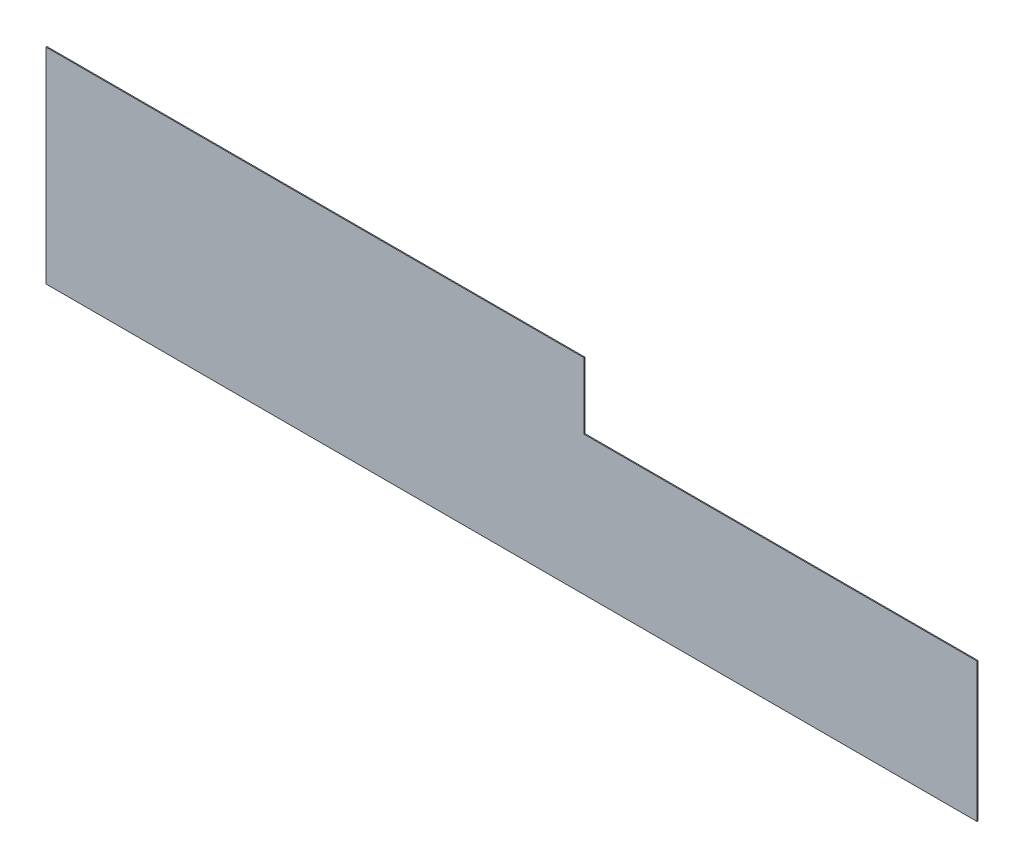
ISO-10303-21;
HEADER;
FILE_DESCRIPTION(('STEP AP214'),'2;1');
FILE_NAME('part.step','',(''),(''),'','','');
FILE_SCHEMA(('AUTOMOTIVE_DESIGN { 1 0 10303 214 1 1 1 1 }'));
ENDSEC;
DATA;
#1=APPLICATION_CONTEXT('core data for automotive mechanical design processes');
#2=APPLICATION_PROTOCOL_DEFINITION('international standard','automotive_design',2000,#1);
#3=PRODUCT_CONTEXT('',#1,'mechanical');
#4=PRODUCT('Part','Part','',(#3));
#5=PRODUCT_RELATED_PRODUCT_CATEGORY('part','',(#4));
#6=PRODUCT_DEFINITION_FORMATION('','',#4);
#7=PRODUCT_DEFINITION_CONTEXT('part definition',#1,'design');
#8=PRODUCT_DEFINITION('design','',#6,#7);
#9=PRODUCT_DEFINITION_SHAPE('','',#8);
#10=(LENGTH_UNIT() NAMED_UNIT(*) SI_UNIT(.MILLI.,.METRE.));
#11=(NAMED_UNIT(*) PLANE_ANGLE_UNIT() SI_UNIT($,.RADIAN.));
#12=(NAMED_UNIT(*) SI_UNIT($,.STERADIAN.) SOLID_ANGLE_UNIT());
#13=UNCERTAINTY_MEASURE_WITH_UNIT(LENGTH_MEASURE(1.E-05),#10,'distance_accuracy_value','');
#14=(GEOMETRIC_REPRESENTATION_CONTEXT(3) GLOBAL_UNCERTAINTY_ASSIGNED_CONTEXT((#13)) GLOBAL_UNIT_ASSIGNED_CONTEXT((#10,
#11,#12)) REPRESENTATION_CONTEXT('',''));
#15=CARTESIAN_POINT('',(0.,0.,0.));
#16=DIRECTION('',(0.,0.,1.));
#17=DIRECTION('',(1.,0.,0.));
#18=AXIS2_PLACEMENT_3D('',#15,#16,#17);
#19=CARTESIAN_POINT('',(5695.,-2.79062878280622E-13,-6.));
#20=DIRECTION('',(0.,-1.,0.));
#21=DIRECTION('',(1.,0.,0.));
#22=AXIS2_PLACEMENT_3D('',#19,#20,#21);
#23=PLANE('',#22);
#24=DIRECTION('',(1.,0.,0.));
#25=VECTOR('',#24,1.);
#26=CARTESIAN_POINT('',(5695.,-2.79062878280622E-13,0.));
#27=LINE('',#26,#25);
#28=CARTESIAN_POINT('',(0.,0.,0.));
#29=VERTEX_POINT('',#28);
#30=CARTESIAN_POINT('',(5695.,-2.79062878280622E-13,0.));
#31=VERTEX_POINT('',#30);
#32=EDGE_CURVE('E123',#29,#31,#27,.T.);
#33=ORIENTED_EDGE('',*,*,#32,.F.);
#34=DIRECTION('',(0.,0.,1.));
#35=VECTOR('',#34,1.);
#36=CARTESIAN_POINT('',(0.,0.,-6.));
#37=LINE('',#36,#35);
#38=CARTESIAN_POINT('',(0.,0.,-6.));
#39=VERTEX_POINT('',#38);
#40=EDGE_CURVE('E11',#39,#29,#37,.T.);
#41=ORIENTED_EDGE('',*,*,#40,.F.);
#42=DIRECTION('',(1.,0.,0.));
#43=VECTOR('',#42,1.);
#44=CARTESIAN_POINT('',(5695.,-2.79062878280622E-13,-6.));
#45=LINE('',#44,#43);
#46=CARTESIAN_POINT('',(5695.,-2.79062878280622E-13,-6.));
#47=VERTEX_POINT('',#46);
#48=EDGE_CURVE('E137',#39,#47,#45,.T.);
#49=ORIENTED_EDGE('',*,*,#48,.T.);
#50=DIRECTION('',(0.,0.,1.));
#51=VECTOR('',#50,1.);
#52=CARTESIAN_POINT('',(5695.,-2.79062878280622E-13,-6.));
#53=LINE('',#52,#51);
#54=EDGE_CURVE('E41',#47,#31,#53,.T.);
#55=ORIENTED_EDGE('',*,*,#54,.T.);
#56=EDGE_LOOP('',(#33,#41,#49,#55));
#57=FACE_BOUND('',#56,.T.);
#58=ADVANCED_FACE('F38',(#57),#23,.T.);
#59=CARTESIAN_POINT('',(0.,0.,-6.));
#60=DIRECTION('',(-1.,0.,0.));
#61=DIRECTION('',(0.,-1.,0.));
#62=AXIS2_PLACEMENT_3D('',#59,#60,#61);
#63=PLANE('',#62);
#64=DIRECTION('',(0.,-1.,0.));
#65=VECTOR('',#64,1.);
#66=CARTESIAN_POINT('',(0.,0.,0.));
#67=LINE('',#66,#65);
#68=CARTESIAN_POINT('',(4.44089209850063E-13,1255.,0.));
#69=VERTEX_POINT('',#68);
#70=EDGE_CURVE('E135',#69,#29,#67,.T.);
#71=ORIENTED_EDGE('',*,*,#70,.F.);
#72=DIRECTION('',(0.,0.,1.));
#73=VECTOR('',#72,1.);
#74=CARTESIAN_POINT('',(4.44089209850063E-13,1255.,-6.));
#75=LINE('',#74,#73);
#76=CARTESIAN_POINT('',(4.44089209850063E-13,1255.,-6.));
#77=VERTEX_POINT('',#76);
#78=EDGE_CURVE('E47',#77,#69,#75,.T.);
#79=ORIENTED_EDGE('',*,*,#78,.F.);
#80=DIRECTION('',(0.,-1.,0.));
#81=VECTOR('',#80,1.);
#82=CARTESIAN_POINT('',(0.,0.,-6.));
#83=LINE('',#82,#81);
#84=EDGE_CURVE('E113',#77,#39,#83,.T.);
#85=ORIENTED_EDGE('',*,*,#84,.T.);
#86=ORIENTED_EDGE('',*,*,#40,.T.);
#87=EDGE_LOOP('',(#71,#79,#85,#86));
#88=FACE_BOUND('',#87,.T.);
#89=ADVANCED_FACE('F145',(#88),#63,.T.);
#90=CARTESIAN_POINT('',(4.44089209850063E-13,1255.,-6.));
#91=DIRECTION('',(0.,1.,0.));
#92=DIRECTION('',(0.,0.,1.));
#93=AXIS2_PLACEMENT_3D('',#90,#91,#92);
#94=PLANE('',#93);
#95=DIRECTION('',(-1.,0.,0.));
#96=VECTOR('',#95,1.);
#97=CARTESIAN_POINT('',(4.44089209850063E-13,1255.,0.));
#98=LINE('',#97,#96);
#99=CARTESIAN_POINT('',(3290.,1255.,0.));
#100=VERTEX_POINT('',#99);
#101=EDGE_CURVE('E100',#100,#69,#98,.T.);
#102=ORIENTED_EDGE('',*,*,#101,.F.);
#103=DIRECTION('',(0.,0.,1.));
#104=VECTOR('',#103,1.);
#105=CARTESIAN_POINT('',(3290.,1255.,-6.));
#106=LINE('',#105,#104);
#107=CARTESIAN_POINT('',(3290.,1255.,-6.));
#108=VERTEX_POINT('',#107);
#109=EDGE_CURVE('E95',#108,#100,#106,.T.);
#110=ORIENTED_EDGE('',*,*,#109,.F.);
#111=DIRECTION('',(-1.,0.,0.));
#112=VECTOR('',#111,1.);
#113=CARTESIAN_POINT('',(4.44089209850063E-13,1255.,-6.));
#114=LINE('',#113,#112);
#115=EDGE_CURVE('E98',#108,#77,#114,.T.);
#116=ORIENTED_EDGE('',*,*,#115,.T.);
#117=ORIENTED_EDGE('',*,*,#78,.T.);
#118=EDGE_LOOP('',(#102,#110,#116,#117));
#119=FACE_BOUND('',#118,.T.);
#120=ADVANCED_FACE('F97',(#119),#94,.T.);
#121=CARTESIAN_POINT('',(3290.,1255.,-6.));
#122=DIRECTION('',(1.,0.,0.));
#123=DIRECTION('',(0.,0.,-1.));
#124=AXIS2_PLACEMENT_3D('',#121,#122,#123);
#125=PLANE('',#124);
#126=DIRECTION('',(0.,1.,0.));
#127=VECTOR('',#126,1.);
#128=CARTESIAN_POINT('',(3290.,1255.,0.));
#129=LINE('',#128,#127);
#130=CARTESIAN_POINT('',(3290.,850.,0.));
#131=VERTEX_POINT('',#130);
#132=EDGE_CURVE('E132',#131,#100,#129,.T.);
#133=ORIENTED_EDGE('',*,*,#132,.F.);
#134=DIRECTION('',(0.,0.,1.));
#135=VECTOR('',#134,1.);
#136=CARTESIAN_POINT('',(3290.,850.,-6.));
#137=LINE('',#136,#135);
#138=CARTESIAN_POINT('',(3290.,850.,-6.));
#139=VERTEX_POINT('',#138);
#140=EDGE_CURVE('E105',#139,#131,#137,.T.);
#141=ORIENTED_EDGE('',*,*,#140,.F.);
#142=DIRECTION('',(0.,1.,0.));
#143=VECTOR('',#142,1.);
#144=CARTESIAN_POINT('',(3290.,1255.,-6.));
#145=LINE('',#144,#143);
#146=EDGE_CURVE('E111',#139,#108,#145,.T.);
#147=ORIENTED_EDGE('',*,*,#146,.T.);
#148=ORIENTED_EDGE('',*,*,#109,.T.);
#149=EDGE_LOOP('',(#133,#141,#147,#148));
#150=FACE_BOUND('',#149,.T.);
#151=ADVANCED_FACE('F115',(#150),#125,.T.);
#152=CARTESIAN_POINT('',(3290.,850.,-6.));
#153=DIRECTION('',(0.,1.,0.));
#154=DIRECTION('',(0.,0.,1.));
#155=AXIS2_PLACEMENT_3D('',#152,#153,#154);
#156=PLANE('',#155);
#157=DIRECTION('',(-1.,0.,0.));
#158=VECTOR('',#157,1.);
#159=CARTESIAN_POINT('',(3290.,850.,0.));
#160=LINE('',#159,#158);
#161=CARTESIAN_POINT('',(5695.,850.,0.));
#162=VERTEX_POINT('',#161);
#163=EDGE_CURVE('E129',#162,#131,#160,.T.);
#164=ORIENTED_EDGE('',*,*,#163,.F.);
#165=DIRECTION('',(0.,0.,1.));
#166=VECTOR('',#165,1.);
#167=CARTESIAN_POINT('',(5695.,850.,-6.));
#168=LINE('',#167,#166);
#169=CARTESIAN_POINT('',(5695.,850.,-6.));
#170=VERTEX_POINT('',#169);
#171=EDGE_CURVE('E140',#170,#162,#168,.T.);
#172=ORIENTED_EDGE('',*,*,#171,.F.);
#173=DIRECTION('',(-1.,0.,0.));
#174=VECTOR('',#173,1.);
#175=CARTESIAN_POINT('',(3290.,850.,-6.));
#176=LINE('',#175,#174);
#177=EDGE_CURVE('E116',#170,#139,#176,.T.);
#178=ORIENTED_EDGE('',*,*,#177,.T.);
#179=ORIENTED_EDGE('',*,*,#140,.T.);
#180=EDGE_LOOP('',(#164,#172,#178,#179));
#181=FACE_BOUND('',#180,.T.);
#182=ADVANCED_FACE('F158',(#181),#156,.T.);
#183=CARTESIAN_POINT('',(5695.,850.,-6.));
#184=DIRECTION('',(1.,0.,0.));
#185=DIRECTION('',(0.,0.,-1.));
#186=AXIS2_PLACEMENT_3D('',#183,#184,#185);
#187=PLANE('',#186);
#188=DIRECTION('',(0.,1.,0.));
#189=VECTOR('',#188,1.);
#190=CARTESIAN_POINT('',(5695.,850.,0.));
#191=LINE('',#190,#189);
#192=EDGE_CURVE('E126',#31,#162,#191,.T.);
#193=ORIENTED_EDGE('',*,*,#192,.F.);
#194=ORIENTED_EDGE('',*,*,#54,.F.);
#195=DIRECTION('',(0.,1.,0.));
#196=VECTOR('',#195,1.);
#197=CARTESIAN_POINT('',(5695.,850.,-6.));
#198=LINE('',#197,#196);
#199=EDGE_CURVE('E118',#47,#170,#198,.T.);
#200=ORIENTED_EDGE('',*,*,#199,.T.);
#201=ORIENTED_EDGE('',*,*,#171,.T.);
#202=EDGE_LOOP('',(#193,#194,#200,#201));
#203=FACE_BOUND('',#202,.T.);
#204=ADVANCED_FACE('F142',(#203),#187,.T.);
#205=CARTESIAN_POINT('',(0.,0.,-6.));
#206=DIRECTION('',(0.,0.,-1.));
#207=DIRECTION('',(-1.,0.,0.));
#208=AXIS2_PLACEMENT_3D('',#205,#206,#207);
#209=PLANE('',#208);
#210=ORIENTED_EDGE('',*,*,#48,.F.);
#211=ORIENTED_EDGE('',*,*,#84,.F.);
#212=ORIENTED_EDGE('',*,*,#115,.F.);
#213=ORIENTED_EDGE('',*,*,#146,.F.);
#214=ORIENTED_EDGE('',*,*,#177,.F.);
#215=ORIENTED_EDGE('',*,*,#199,.F.);
#216=EDGE_LOOP('',(#210,#211,#212,#213,#214,#215));
#217=FACE_BOUND('',#216,.T.);
#218=ADVANCED_FACE('F109',(#217),#209,.T.);
#219=CARTESIAN_POINT('',(0.,0.,0.));
#220=DIRECTION('',(0.,0.,-1.));
#221=DIRECTION('',(-1.,0.,0.));
#222=AXIS2_PLACEMENT_3D('',#219,#220,#221);
#223=PLANE('',#222);
#224=ORIENTED_EDGE('',*,*,#32,.T.);
#225=ORIENTED_EDGE('',*,*,#192,.T.);
#226=ORIENTED_EDGE('',*,*,#163,.T.);
#227=ORIENTED_EDGE('',*,*,#132,.T.);
#228=ORIENTED_EDGE('',*,*,#101,.T.);
#229=ORIENTED_EDGE('',*,*,#70,.T.);
#230=EDGE_LOOP('',(#224,#225,#226,#227,#228,#229));
#231=FACE_BOUND('',#230,.T.);
#232=ADVANCED_FACE('F144',(#231),#223,.F.);
#233=CLOSED_SHELL('',(#58,#89,#120,#151,#182,#204,#218,#232));
#234=MANIFOLD_SOLID_BREP('B2',#233);
#235=ADVANCED_BREP_SHAPE_REPRESENTATION('',(#18,#234),#14);
#236=SHAPE_DEFINITION_REPRESENTATION(#9,#235);
ENDSEC;
END-ISO-10303-21;
